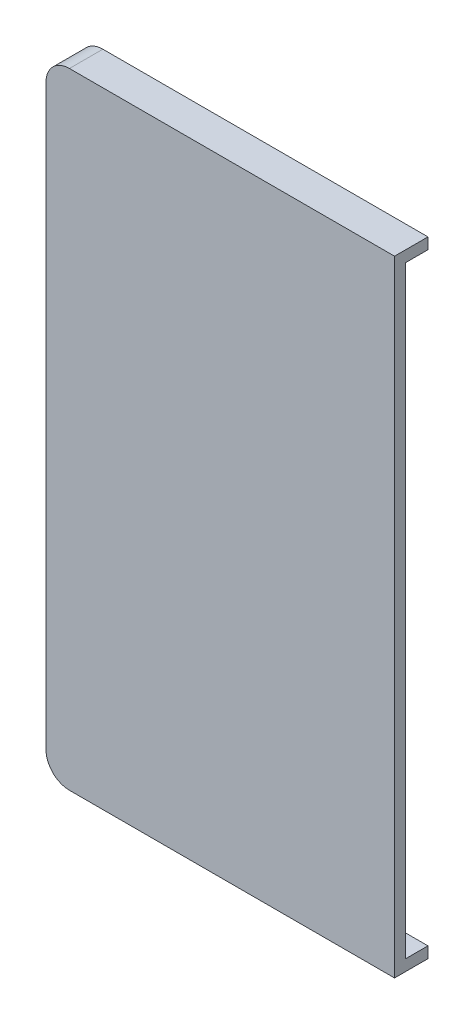
ISO-10303-21;
HEADER;
FILE_DESCRIPTION(('STEP AP214'),'2;1');
FILE_NAME('part.step','',(''),(''),'','','');
FILE_SCHEMA(('AUTOMOTIVE_DESIGN { 1 0 10303 214 1 1 1 1 }'));
ENDSEC;
DATA;
#1=APPLICATION_CONTEXT('core data for automotive mechanical design processes');
#2=APPLICATION_PROTOCOL_DEFINITION('international standard','automotive_design',2000,#1);
#3=PRODUCT_CONTEXT('',#1,'mechanical');
#4=PRODUCT('Part','Part','',(#3));
#5=PRODUCT_RELATED_PRODUCT_CATEGORY('part','',(#4));
#6=PRODUCT_DEFINITION_FORMATION('','',#4);
#7=PRODUCT_DEFINITION_CONTEXT('part definition',#1,'design');
#8=PRODUCT_DEFINITION('design','',#6,#7);
#9=PRODUCT_DEFINITION_SHAPE('','',#8);
#10=(LENGTH_UNIT() NAMED_UNIT(*) SI_UNIT(.MILLI.,.METRE.));
#11=(NAMED_UNIT(*) PLANE_ANGLE_UNIT() SI_UNIT($,.RADIAN.));
#12=(NAMED_UNIT(*) SI_UNIT($,.STERADIAN.) SOLID_ANGLE_UNIT());
#13=UNCERTAINTY_MEASURE_WITH_UNIT(LENGTH_MEASURE(1.E-05),#10,'distance_accuracy_value','');
#14=(GEOMETRIC_REPRESENTATION_CONTEXT(3) GLOBAL_UNCERTAINTY_ASSIGNED_CONTEXT((#13)) GLOBAL_UNIT_ASSIGNED_CONTEXT((#10,
#11,#12)) REPRESENTATION_CONTEXT('',''));
#15=CARTESIAN_POINT('',(0.,0.,0.));
#16=DIRECTION('',(0.,0.,1.));
#17=DIRECTION('',(1.,0.,0.));
#18=AXIS2_PLACEMENT_3D('',#15,#16,#17);
#19=CARTESIAN_POINT('',(0.,0.,0.));
#20=DIRECTION('',(0.,0.,1.));
#21=DIRECTION('',(1.,0.,0.));
#22=AXIS2_PLACEMENT_3D('',#19,#20,#21);
#23=PLANE('',#22);
#24=DIRECTION('',(-1.,0.,0.));
#25=VECTOR('',#24,1.);
#26=CARTESIAN_POINT('',(0.,-1228.03095123141,0.));
#27=LINE('',#26,#25);
#28=CARTESIAN_POINT('',(719.851242052019,-1228.03095123141,0.));
#29=VERTEX_POINT('',#28);
#30=CARTESIAN_POINT('',(661.511242052019,-1228.03095123141,0.));
#31=VERTEX_POINT('',#30);
#32=EDGE_CURVE('E150',#29,#31,#27,.T.);
#33=ORIENTED_EDGE('',*,*,#32,.F.);
#34=DIRECTION('',(0.,1.,0.));
#35=VECTOR('',#34,1.);
#36=CARTESIAN_POINT('',(719.851242052019,0.,0.));
#37=LINE('',#36,#35);
#38=CARTESIAN_POINT('',(719.851242052019,-1336.21095123141,0.));
#39=VERTEX_POINT('',#38);
#40=EDGE_CURVE('E211',#39,#29,#37,.T.);
#41=ORIENTED_EDGE('',*,*,#40,.F.);
#42=DIRECTION('',(1.,0.,0.));
#43=VECTOR('',#42,1.);
#44=CARTESIAN_POINT('',(0.,-1336.21095123141,0.));
#45=LINE('',#44,#43);
#46=CARTESIAN_POINT('',(661.511242052019,-1336.21095123141,0.));
#47=VERTEX_POINT('',#46);
#48=EDGE_CURVE('E68',#47,#39,#45,.T.);
#49=ORIENTED_EDGE('',*,*,#48,.F.);
#50=CARTESIAN_POINT('',(661.511242052019,-1334.01095123141,0.));
#51=DIRECTION('',(0.,0.,1.));
#52=DIRECTION('',(1.,0.,0.));
#53=AXIS2_PLACEMENT_3D('',#50,#51,#52);
#54=CIRCLE('',#53,2.19999999999998);
#55=CARTESIAN_POINT('',(659.311242052019,-1334.01095123141,0.));
#56=VERTEX_POINT('',#55);
#57=EDGE_CURVE('E164',#56,#47,#54,.T.);
#58=ORIENTED_EDGE('',*,*,#57,.F.);
#59=DIRECTION('',(0.,-1.,0.));
#60=VECTOR('',#59,1.);
#61=CARTESIAN_POINT('',(659.311242052019,0.,0.));
#62=LINE('',#61,#60);
#63=CARTESIAN_POINT('',(659.311242052019,-1230.23095123141,0.));
#64=VERTEX_POINT('',#63);
#65=EDGE_CURVE('E160',#64,#56,#62,.T.);
#66=ORIENTED_EDGE('',*,*,#65,.F.);
#67=CARTESIAN_POINT('',(661.511242052019,-1230.23095123141,0.));
#68=DIRECTION('',(0.,0.,1.));
#69=DIRECTION('',(1.,0.,0.));
#70=AXIS2_PLACEMENT_3D('',#67,#68,#69);
#71=CIRCLE('',#70,2.19999999999998);
#72=EDGE_CURVE('E61',#31,#64,#71,.T.);
#73=ORIENTED_EDGE('',*,*,#72,.F.);
#74=EDGE_LOOP('',(#33,#41,#49,#58,#66,#73));
#75=FACE_BOUND('',#74,.T.);
#76=ADVANCED_FACE('F45',(#75),#23,.F.);
#77=CARTESIAN_POINT('',(0.,-1338.21095123141,2.));
#78=DIRECTION('',(0.,1.,0.));
#79=DIRECTION('',(0.,0.,1.));
#80=AXIS2_PLACEMENT_3D('',#77,#78,#79);
#81=PLANE('',#80);
#82=DIRECTION('',(0.,0.,-1.));
#83=VECTOR('',#82,1.);
#84=CARTESIAN_POINT('',(661.511242052019,-1338.21095123141,2.));
#85=LINE('',#84,#83);
#86=CARTESIAN_POINT('',(661.511242052019,-1338.21095123141,2.));
#87=VERTEX_POINT('',#86);
#88=CARTESIAN_POINT('',(661.511242052019,-1338.21095123141,-4.));
#89=VERTEX_POINT('',#88);
#90=EDGE_CURVE('E245',#87,#89,#85,.T.);
#91=ORIENTED_EDGE('',*,*,#90,.T.);
#92=DIRECTION('',(1.,0.,0.));
#93=VECTOR('',#92,1.);
#94=CARTESIAN_POINT('',(0.,-1338.21095123141,-4.));
#95=LINE('',#94,#93);
#96=CARTESIAN_POINT('',(719.851242052019,-1338.21095123141,-4.));
#97=VERTEX_POINT('',#96);
#98=EDGE_CURVE('E185',#89,#97,#95,.T.);
#99=ORIENTED_EDGE('',*,*,#98,.T.);
#100=DIRECTION('',(0.,0.,-1.));
#101=VECTOR('',#100,1.);
#102=CARTESIAN_POINT('',(719.851242052019,-1338.21095123141,2.));
#103=LINE('',#102,#101);
#104=CARTESIAN_POINT('',(719.851242052019,-1338.21095123141,2.));
#105=VERTEX_POINT('',#104);
#106=EDGE_CURVE('E11',#105,#97,#103,.T.);
#107=ORIENTED_EDGE('',*,*,#106,.F.);
#108=DIRECTION('',(1.,0.,0.));
#109=VECTOR('',#108,1.);
#110=CARTESIAN_POINT('',(0.,-1338.21095123141,2.));
#111=LINE('',#110,#109);
#112=EDGE_CURVE('E226',#87,#105,#111,.T.);
#113=ORIENTED_EDGE('',*,*,#112,.F.);
#114=EDGE_LOOP('',(#91,#99,#107,#113));
#115=FACE_BOUND('',#114,.T.);
#116=ADVANCED_FACE('F47',(#115),#81,.F.);
#117=CARTESIAN_POINT('',(719.851242052019,0.,2.));
#118=DIRECTION('',(-1.,0.,0.));
#119=DIRECTION('',(0.,0.,1.));
#120=AXIS2_PLACEMENT_3D('',#117,#118,#119);
#121=PLANE('',#120);
#122=ORIENTED_EDGE('',*,*,#106,.T.);
#123=DIRECTION('',(0.,-1.,0.));
#124=VECTOR('',#123,1.);
#125=CARTESIAN_POINT('',(719.851242052019,0.,-4.));
#126=LINE('',#125,#124);
#127=CARTESIAN_POINT('',(719.851242052019,-1336.21095123141,-4.));
#128=VERTEX_POINT('',#127);
#129=EDGE_CURVE('E189',#128,#97,#126,.T.);
#130=ORIENTED_EDGE('',*,*,#129,.F.);
#131=DIRECTION('',(0.,0.,1.));
#132=VECTOR('',#131,1.);
#133=CARTESIAN_POINT('',(719.851242052019,-1336.21095123141,-4.));
#134=LINE('',#133,#132);
#135=EDGE_CURVE('E220',#128,#39,#134,.T.);
#136=ORIENTED_EDGE('',*,*,#135,.T.);
#137=ORIENTED_EDGE('',*,*,#40,.T.);
#138=DIRECTION('',(0.,0.,1.));
#139=VECTOR('',#138,1.);
#140=CARTESIAN_POINT('',(719.851242052019,-1228.03095123141,-4.));
#141=LINE('',#140,#139);
#142=CARTESIAN_POINT('',(719.851242052019,-1228.03095123141,-4.));
#143=VERTEX_POINT('',#142);
#144=EDGE_CURVE('E153',#143,#29,#141,.T.);
#145=ORIENTED_EDGE('',*,*,#144,.F.);
#146=DIRECTION('',(0.,1.,0.));
#147=VECTOR('',#146,1.);
#148=CARTESIAN_POINT('',(719.851242052019,0.,-4.));
#149=LINE('',#148,#147);
#150=CARTESIAN_POINT('',(719.851242052019,-1226.03095123141,-4.));
#151=VERTEX_POINT('',#150);
#152=EDGE_CURVE('E142',#143,#151,#149,.T.);
#153=ORIENTED_EDGE('',*,*,#152,.T.);
#154=DIRECTION('',(0.,0.,-1.));
#155=VECTOR('',#154,1.);
#156=CARTESIAN_POINT('',(719.851242052019,-1226.03095123141,2.));
#157=LINE('',#156,#155);
#158=CARTESIAN_POINT('',(719.851242052019,-1226.03095123141,2.));
#159=VERTEX_POINT('',#158);
#160=EDGE_CURVE('E54',#159,#151,#157,.T.);
#161=ORIENTED_EDGE('',*,*,#160,.F.);
#162=DIRECTION('',(0.,1.,0.));
#163=VECTOR('',#162,1.);
#164=CARTESIAN_POINT('',(719.851242052019,0.,2.));
#165=LINE('',#164,#163);
#166=EDGE_CURVE('E230',#105,#159,#165,.T.);
#167=ORIENTED_EDGE('',*,*,#166,.F.);
#168=EDGE_LOOP('',(#122,#130,#136,#137,#145,#153,#161,#167));
#169=FACE_BOUND('',#168,.T.);
#170=ADVANCED_FACE('F268',(#169),#121,.F.);
#171=CARTESIAN_POINT('',(0.,-1226.03095123141,2.));
#172=DIRECTION('',(0.,-1.,0.));
#173=DIRECTION('',(0.,0.,-1.));
#174=AXIS2_PLACEMENT_3D('',#171,#172,#173);
#175=PLANE('',#174);
#176=ORIENTED_EDGE('',*,*,#160,.T.);
#177=DIRECTION('',(-1.,0.,0.));
#178=VECTOR('',#177,1.);
#179=CARTESIAN_POINT('',(0.,-1226.03095123141,-4.));
#180=LINE('',#179,#178);
#181=CARTESIAN_POINT('',(661.511242052019,-1226.03095123141,-4.));
#182=VERTEX_POINT('',#181);
#183=EDGE_CURVE('E169',#151,#182,#180,.T.);
#184=ORIENTED_EDGE('',*,*,#183,.T.);
#185=DIRECTION('',(0.,0.,-1.));
#186=VECTOR('',#185,1.);
#187=CARTESIAN_POINT('',(661.511242052019,-1226.03095123141,2.));
#188=LINE('',#187,#186);
#189=CARTESIAN_POINT('',(661.511242052019,-1226.03095123141,2.));
#190=VERTEX_POINT('',#189);
#191=EDGE_CURVE('E257',#190,#182,#188,.T.);
#192=ORIENTED_EDGE('',*,*,#191,.F.);
#193=DIRECTION('',(-1.,0.,0.));
#194=VECTOR('',#193,1.);
#195=CARTESIAN_POINT('',(0.,-1226.03095123141,2.));
#196=LINE('',#195,#194);
#197=EDGE_CURVE('E233',#159,#190,#196,.T.);
#198=ORIENTED_EDGE('',*,*,#197,.F.);
#199=EDGE_LOOP('',(#176,#184,#192,#198));
#200=FACE_BOUND('',#199,.T.);
#201=ADVANCED_FACE('F263',(#200),#175,.F.);
#202=CARTESIAN_POINT('',(661.511242052019,-1230.23095123141,2.));
#203=DIRECTION('',(0.,0.,-1.));
#204=DIRECTION('',(-1.,0.,0.));
#205=AXIS2_PLACEMENT_3D('',#202,#203,#204);
#206=CYLINDRICAL_SURFACE('',#205,4.19999999999998);
#207=ORIENTED_EDGE('',*,*,#191,.T.);
#208=CARTESIAN_POINT('',(661.511242052019,-1230.23095123141,-4.));
#209=DIRECTION('',(0.,0.,1.));
#210=DIRECTION('',(1.,0.,0.));
#211=AXIS2_PLACEMENT_3D('',#208,#209,#210);
#212=CIRCLE('',#211,4.19999999999998);
#213=CARTESIAN_POINT('',(657.311242052019,-1230.23095123141,-4.));
#214=VERTEX_POINT('',#213);
#215=EDGE_CURVE('E173',#182,#214,#212,.T.);
#216=ORIENTED_EDGE('',*,*,#215,.T.);
#217=DIRECTION('',(0.,0.,-1.));
#218=VECTOR('',#217,1.);
#219=CARTESIAN_POINT('',(657.311242052019,-1230.23095123141,2.));
#220=LINE('',#219,#218);
#221=CARTESIAN_POINT('',(657.311242052019,-1230.23095123141,2.));
#222=VERTEX_POINT('',#221);
#223=EDGE_CURVE('E254',#222,#214,#220,.T.);
#224=ORIENTED_EDGE('',*,*,#223,.F.);
#225=CARTESIAN_POINT('',(661.511242052019,-1230.23095123141,2.));
#226=DIRECTION('',(0.,0.,1.));
#227=DIRECTION('',(1.,0.,0.));
#228=AXIS2_PLACEMENT_3D('',#225,#226,#227);
#229=CIRCLE('',#228,4.19999999999998);
#230=EDGE_CURVE('E236',#190,#222,#229,.T.);
#231=ORIENTED_EDGE('',*,*,#230,.F.);
#232=EDGE_LOOP('',(#207,#216,#224,#231));
#233=FACE_BOUND('',#232,.T.);
#234=ADVANCED_FACE('F297',(#233),#206,.T.);
#235=CARTESIAN_POINT('',(657.311242052019,0.,2.));
#236=DIRECTION('',(1.,0.,0.));
#237=DIRECTION('',(0.,0.,-1.));
#238=AXIS2_PLACEMENT_3D('',#235,#236,#237);
#239=PLANE('',#238);
#240=ORIENTED_EDGE('',*,*,#223,.T.);
#241=DIRECTION('',(0.,-1.,0.));
#242=VECTOR('',#241,1.);
#243=CARTESIAN_POINT('',(657.311242052019,0.,-4.));
#244=LINE('',#243,#242);
#245=CARTESIAN_POINT('',(657.311242052019,-1334.01095123141,-4.));
#246=VERTEX_POINT('',#245);
#247=EDGE_CURVE('E177',#214,#246,#244,.T.);
#248=ORIENTED_EDGE('',*,*,#247,.T.);
#249=DIRECTION('',(0.,0.,-1.));
#250=VECTOR('',#249,1.);
#251=CARTESIAN_POINT('',(657.311242052019,-1334.01095123141,2.));
#252=LINE('',#251,#250);
#253=CARTESIAN_POINT('',(657.311242052019,-1334.01095123141,2.));
#254=VERTEX_POINT('',#253);
#255=EDGE_CURVE('E251',#254,#246,#252,.T.);
#256=ORIENTED_EDGE('',*,*,#255,.F.);
#257=DIRECTION('',(0.,-1.,0.));
#258=VECTOR('',#257,1.);
#259=CARTESIAN_POINT('',(657.311242052019,0.,2.));
#260=LINE('',#259,#258);
#261=EDGE_CURVE('E239',#222,#254,#260,.T.);
#262=ORIENTED_EDGE('',*,*,#261,.F.);
#263=EDGE_LOOP('',(#240,#248,#256,#262));
#264=FACE_BOUND('',#263,.T.);
#265=ADVANCED_FACE('F292',(#264),#239,.F.);
#266=CARTESIAN_POINT('',(661.511242052019,-1334.01095123141,2.));
#267=DIRECTION('',(0.,0.,-1.));
#268=DIRECTION('',(-1.,0.,0.));
#269=AXIS2_PLACEMENT_3D('',#266,#267,#268);
#270=CYLINDRICAL_SURFACE('',#269,4.19999999999998);
#271=ORIENTED_EDGE('',*,*,#255,.T.);
#272=CARTESIAN_POINT('',(661.511242052019,-1334.01095123141,-4.));
#273=DIRECTION('',(0.,0.,1.));
#274=DIRECTION('',(1.,0.,0.));
#275=AXIS2_PLACEMENT_3D('',#272,#273,#274);
#276=CIRCLE('',#275,4.19999999999998);
#277=EDGE_CURVE('E181',#246,#89,#276,.T.);
#278=ORIENTED_EDGE('',*,*,#277,.T.);
#279=ORIENTED_EDGE('',*,*,#90,.F.);
#280=CARTESIAN_POINT('',(661.511242052019,-1334.01095123141,2.));
#281=DIRECTION('',(0.,0.,1.));
#282=DIRECTION('',(1.,0.,0.));
#283=AXIS2_PLACEMENT_3D('',#280,#281,#282);
#284=CIRCLE('',#283,4.19999999999998);
#285=EDGE_CURVE('E242',#254,#87,#284,.T.);
#286=ORIENTED_EDGE('',*,*,#285,.F.);
#287=EDGE_LOOP('',(#271,#278,#279,#286));
#288=FACE_BOUND('',#287,.T.);
#289=ADVANCED_FACE('F289',(#288),#270,.T.);
#290=CARTESIAN_POINT('',(0.,0.,2.));
#291=DIRECTION('',(0.,0.,1.));
#292=DIRECTION('',(1.,0.,0.));
#293=AXIS2_PLACEMENT_3D('',#290,#291,#292);
#294=PLANE('',#293);
#295=ORIENTED_EDGE('',*,*,#112,.T.);
#296=ORIENTED_EDGE('',*,*,#166,.T.);
#297=ORIENTED_EDGE('',*,*,#197,.T.);
#298=ORIENTED_EDGE('',*,*,#230,.T.);
#299=ORIENTED_EDGE('',*,*,#261,.T.);
#300=ORIENTED_EDGE('',*,*,#285,.T.);
#301=EDGE_LOOP('',(#295,#296,#297,#298,#299,#300));
#302=FACE_BOUND('',#301,.T.);
#303=ADVANCED_FACE('F299',(#302),#294,.T.);
#304=CARTESIAN_POINT('',(661.511242052019,-1230.23095123141,-4.));
#305=DIRECTION('',(0.,0.,1.));
#306=DIRECTION('',(1.,0.,0.));
#307=AXIS2_PLACEMENT_3D('',#304,#305,#306);
#308=CYLINDRICAL_SURFACE('',#307,2.19999999999998);
#309=ORIENTED_EDGE('',*,*,#72,.T.);
#310=DIRECTION('',(0.,0.,1.));
#311=VECTOR('',#310,1.);
#312=CARTESIAN_POINT('',(659.311242052019,-1230.23095123141,-4.));
#313=LINE('',#312,#311);
#314=CARTESIAN_POINT('',(659.311242052019,-1230.23095123141,-4.));
#315=VERTEX_POINT('',#314);
#316=EDGE_CURVE('E158',#315,#64,#313,.T.);
#317=ORIENTED_EDGE('',*,*,#316,.F.);
#318=CARTESIAN_POINT('',(661.511242052019,-1230.23095123141,-4.));
#319=DIRECTION('',(0.,0.,1.));
#320=DIRECTION('',(1.,0.,0.));
#321=AXIS2_PLACEMENT_3D('',#318,#319,#320);
#322=CIRCLE('',#321,2.19999999999998);
#323=CARTESIAN_POINT('',(661.511242052019,-1228.03095123141,-4.));
#324=VERTEX_POINT('',#323);
#325=EDGE_CURVE('E138',#324,#315,#322,.T.);
#326=ORIENTED_EDGE('',*,*,#325,.F.);
#327=DIRECTION('',(0.,0.,1.));
#328=VECTOR('',#327,1.);
#329=CARTESIAN_POINT('',(661.511242052019,-1228.03095123141,-4.));
#330=LINE('',#329,#328);
#331=EDGE_CURVE('E148',#324,#31,#330,.T.);
#332=ORIENTED_EDGE('',*,*,#331,.T.);
#333=EDGE_LOOP('',(#309,#317,#326,#332));
#334=FACE_BOUND('',#333,.T.);
#335=ADVANCED_FACE('F156',(#334),#308,.F.);
#336=CARTESIAN_POINT('',(659.311242052019,0.,-4.));
#337=DIRECTION('',(-1.,0.,0.));
#338=DIRECTION('',(0.,0.,1.));
#339=AXIS2_PLACEMENT_3D('',#336,#337,#338);
#340=PLANE('',#339);
#341=ORIENTED_EDGE('',*,*,#65,.T.);
#342=DIRECTION('',(0.,0.,1.));
#343=VECTOR('',#342,1.);
#344=CARTESIAN_POINT('',(659.311242052019,-1334.01095123141,-4.));
#345=LINE('',#344,#343);
#346=CARTESIAN_POINT('',(659.311242052019,-1334.01095123141,-4.));
#347=VERTEX_POINT('',#346);
#348=EDGE_CURVE('E212',#347,#56,#345,.T.);
#349=ORIENTED_EDGE('',*,*,#348,.F.);
#350=DIRECTION('',(0.,-1.,0.));
#351=VECTOR('',#350,1.);
#352=CARTESIAN_POINT('',(659.311242052019,0.,-4.));
#353=LINE('',#352,#351);
#354=EDGE_CURVE('E154',#315,#347,#353,.T.);
#355=ORIENTED_EDGE('',*,*,#354,.F.);
#356=ORIENTED_EDGE('',*,*,#316,.T.);
#357=EDGE_LOOP('',(#341,#349,#355,#356));
#358=FACE_BOUND('',#357,.T.);
#359=ADVANCED_FACE('F280',(#358),#340,.F.);
#360=CARTESIAN_POINT('',(661.511242052019,-1334.01095123141,-4.));
#361=DIRECTION('',(0.,0.,1.));
#362=DIRECTION('',(1.,0.,0.));
#363=AXIS2_PLACEMENT_3D('',#360,#361,#362);
#364=CYLINDRICAL_SURFACE('',#363,2.19999999999998);
#365=ORIENTED_EDGE('',*,*,#57,.T.);
#366=DIRECTION('',(0.,0.,1.));
#367=VECTOR('',#366,1.);
#368=CARTESIAN_POINT('',(661.511242052019,-1336.21095123141,-4.));
#369=LINE('',#368,#367);
#370=CARTESIAN_POINT('',(661.511242052019,-1336.21095123141,-4.));
#371=VERTEX_POINT('',#370);
#372=EDGE_CURVE('E216',#371,#47,#369,.T.);
#373=ORIENTED_EDGE('',*,*,#372,.F.);
#374=CARTESIAN_POINT('',(661.511242052019,-1334.01095123141,-4.));
#375=DIRECTION('',(0.,0.,1.));
#376=DIRECTION('',(1.,0.,0.));
#377=AXIS2_PLACEMENT_3D('',#374,#375,#376);
#378=CIRCLE('',#377,2.19999999999998);
#379=EDGE_CURVE('E196',#347,#371,#378,.T.);
#380=ORIENTED_EDGE('',*,*,#379,.F.);
#381=ORIENTED_EDGE('',*,*,#348,.T.);
#382=EDGE_LOOP('',(#365,#373,#380,#381));
#383=FACE_BOUND('',#382,.T.);
#384=ADVANCED_FACE('F277',(#383),#364,.F.);
#385=CARTESIAN_POINT('',(0.,-1336.21095123141,-4.));
#386=DIRECTION('',(0.,-1.,0.));
#387=DIRECTION('',(0.,0.,-1.));
#388=AXIS2_PLACEMENT_3D('',#385,#386,#387);
#389=PLANE('',#388);
#390=ORIENTED_EDGE('',*,*,#48,.T.);
#391=ORIENTED_EDGE('',*,*,#135,.F.);
#392=DIRECTION('',(1.,0.,0.));
#393=VECTOR('',#392,1.);
#394=CARTESIAN_POINT('',(0.,-1336.21095123141,-4.));
#395=LINE('',#394,#393);
#396=EDGE_CURVE('E193',#371,#128,#395,.T.);
#397=ORIENTED_EDGE('',*,*,#396,.F.);
#398=ORIENTED_EDGE('',*,*,#372,.T.);
#399=EDGE_LOOP('',(#390,#391,#397,#398));
#400=FACE_BOUND('',#399,.T.);
#401=ADVANCED_FACE('F272',(#400),#389,.F.);
#402=CARTESIAN_POINT('',(0.,-1228.03095123141,-4.));
#403=DIRECTION('',(0.,1.,0.));
#404=DIRECTION('',(0.,0.,1.));
#405=AXIS2_PLACEMENT_3D('',#402,#403,#404);
#406=PLANE('',#405);
#407=ORIENTED_EDGE('',*,*,#32,.T.);
#408=ORIENTED_EDGE('',*,*,#331,.F.);
#409=DIRECTION('',(-1.,0.,0.));
#410=VECTOR('',#409,1.);
#411=CARTESIAN_POINT('',(0.,-1228.03095123141,-4.));
#412=LINE('',#411,#410);
#413=EDGE_CURVE('E134',#143,#324,#412,.T.);
#414=ORIENTED_EDGE('',*,*,#413,.F.);
#415=ORIENTED_EDGE('',*,*,#144,.T.);
#416=EDGE_LOOP('',(#407,#408,#414,#415));
#417=FACE_BOUND('',#416,.T.);
#418=ADVANCED_FACE('F149',(#417),#406,.F.);
#419=CARTESIAN_POINT('',(0.,0.,-4.));
#420=DIRECTION('',(0.,0.,1.));
#421=DIRECTION('',(1.,0.,0.));
#422=AXIS2_PLACEMENT_3D('',#419,#420,#421);
#423=PLANE('',#422);
#424=ORIENTED_EDGE('',*,*,#325,.T.);
#425=ORIENTED_EDGE('',*,*,#354,.T.);
#426=ORIENTED_EDGE('',*,*,#379,.T.);
#427=ORIENTED_EDGE('',*,*,#396,.T.);
#428=ORIENTED_EDGE('',*,*,#129,.T.);
#429=ORIENTED_EDGE('',*,*,#98,.F.);
#430=ORIENTED_EDGE('',*,*,#277,.F.);
#431=ORIENTED_EDGE('',*,*,#247,.F.);
#432=ORIENTED_EDGE('',*,*,#215,.F.);
#433=ORIENTED_EDGE('',*,*,#183,.F.);
#434=ORIENTED_EDGE('',*,*,#152,.F.);
#435=ORIENTED_EDGE('',*,*,#413,.T.);
#436=EDGE_LOOP('',(#424,#425,#426,#427,#428,#429,#430,#431,#432,#433,#434,#435));
#437=FACE_BOUND('',#436,.T.);
#438=ADVANCED_FACE('F136',(#437),#423,.F.);
#439=CLOSED_SHELL('',(#76,#116,#170,#201,#234,#265,#289,#303,#335,#359,#384,#401,#418,#438));
#440=MANIFOLD_SOLID_BREP('B2',#439);
#441=ADVANCED_BREP_SHAPE_REPRESENTATION('',(#18,#440),#14);
#442=SHAPE_DEFINITION_REPRESENTATION(#9,#441);
ENDSEC;
END-ISO-10303-21;
